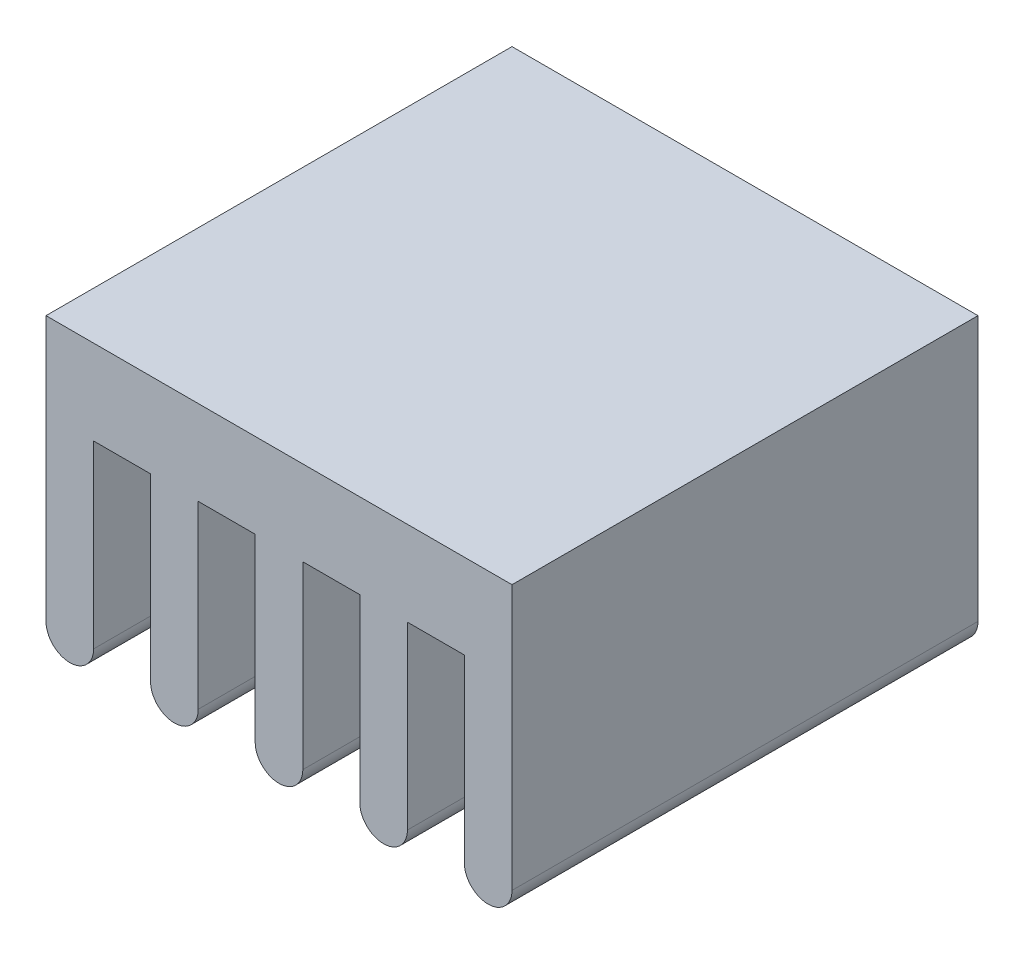
ISO-10303-21;
HEADER;
FILE_DESCRIPTION(('STEP AP214'),'2;1');
FILE_NAME('part.step','',(''),(''),'','','');
FILE_SCHEMA(('AUTOMOTIVE_DESIGN { 1 0 10303 214 1 1 1 1 }'));
ENDSEC;
DATA;
#1=APPLICATION_CONTEXT('core data for automotive mechanical design processes');
#2=APPLICATION_PROTOCOL_DEFINITION('international standard','automotive_design',2000,#1);
#3=PRODUCT_CONTEXT('',#1,'mechanical');
#4=PRODUCT('Part','Part','',(#3));
#5=PRODUCT_RELATED_PRODUCT_CATEGORY('part','',(#4));
#6=PRODUCT_DEFINITION_FORMATION('','',#4);
#7=PRODUCT_DEFINITION_CONTEXT('part definition',#1,'design');
#8=PRODUCT_DEFINITION('design','',#6,#7);
#9=PRODUCT_DEFINITION_SHAPE('','',#8);
#10=(LENGTH_UNIT() NAMED_UNIT(*) SI_UNIT(.MILLI.,.METRE.));
#11=(NAMED_UNIT(*) PLANE_ANGLE_UNIT() SI_UNIT($,.RADIAN.));
#12=(NAMED_UNIT(*) SI_UNIT($,.STERADIAN.) SOLID_ANGLE_UNIT());
#13=UNCERTAINTY_MEASURE_WITH_UNIT(LENGTH_MEASURE(1.E-05),#10,'distance_accuracy_value','');
#14=(GEOMETRIC_REPRESENTATION_CONTEXT(3) GLOBAL_UNCERTAINTY_ASSIGNED_CONTEXT((#13)) GLOBAL_UNIT_ASSIGNED_CONTEXT((#10,
#11,#12)) REPRESENTATION_CONTEXT('',''));
#15=CARTESIAN_POINT('',(0.,0.,0.));
#16=DIRECTION('',(0.,0.,1.));
#17=DIRECTION('',(1.,0.,0.));
#18=AXIS2_PLACEMENT_3D('',#15,#16,#17);
#19=CARTESIAN_POINT('',(0.,0.,4.4));
#20=DIRECTION('',(1.,0.,0.));
#21=DIRECTION('',(0.,1.,0.));
#22=AXIS2_PLACEMENT_3D('',#19,#20,#21);
#23=PLANE('',#22);
#24=DIRECTION('',(0.,-1.,0.));
#25=VECTOR('',#24,1.);
#26=CARTESIAN_POINT('',(0.,0.,-4.4));
#27=LINE('',#26,#25);
#28=CARTESIAN_POINT('',(0.,0.,-4.4));
#29=VERTEX_POINT('',#28);
#30=CARTESIAN_POINT('',(0.,-5.,-4.4));
#31=VERTEX_POINT('',#30);
#32=EDGE_CURVE('E201',#29,#31,#27,.T.);
#33=ORIENTED_EDGE('',*,*,#32,.T.);
#34=DIRECTION('',(0.,0.,-1.));
#35=VECTOR('',#34,1.);
#36=CARTESIAN_POINT('',(0.,-5.,4.4));
#37=LINE('',#36,#35);
#38=CARTESIAN_POINT('',(0.,-5.,4.4));
#39=VERTEX_POINT('',#38);
#40=EDGE_CURVE('E11',#39,#31,#37,.T.);
#41=ORIENTED_EDGE('',*,*,#40,.F.);
#42=DIRECTION('',(0.,-1.,0.));
#43=VECTOR('',#42,1.);
#44=CARTESIAN_POINT('',(0.,0.,4.4));
#45=LINE('',#44,#43);
#46=CARTESIAN_POINT('',(0.,0.,4.4));
#47=VERTEX_POINT('',#46);
#48=EDGE_CURVE('E239',#47,#39,#45,.T.);
#49=ORIENTED_EDGE('',*,*,#48,.F.);
#50=DIRECTION('',(0.,0.,-1.));
#51=VECTOR('',#50,1.);
#52=CARTESIAN_POINT('',(0.,0.,4.4));
#53=LINE('',#52,#51);
#54=EDGE_CURVE('E197',#47,#29,#53,.T.);
#55=ORIENTED_EDGE('',*,*,#54,.T.);
#56=EDGE_LOOP('',(#33,#41,#49,#55));
#57=FACE_BOUND('',#56,.T.);
#58=ADVANCED_FACE('F33',(#57),#23,.F.);
#59=CARTESIAN_POINT('',(0.450000000000001,-5.,4.4));
#60=DIRECTION('',(0.,0.,-1.));
#61=DIRECTION('',(-1.,0.,0.));
#62=AXIS2_PLACEMENT_3D('',#59,#60,#61);
#63=CYLINDRICAL_SURFACE('',#62,0.45);
#64=CARTESIAN_POINT('',(0.450000000000001,-5.,-4.4));
#65=DIRECTION('',(0.,0.,1.));
#66=DIRECTION('',(1.,0.,0.));
#67=AXIS2_PLACEMENT_3D('',#64,#65,#66);
#68=CIRCLE('',#67,0.45);
#69=CARTESIAN_POINT('',(0.900000000000001,-5.,-4.4));
#70=VERTEX_POINT('',#69);
#71=EDGE_CURVE('E204',#31,#70,#68,.T.);
#72=ORIENTED_EDGE('',*,*,#71,.T.);
#73=DIRECTION('',(0.,0.,-1.));
#74=VECTOR('',#73,1.);
#75=CARTESIAN_POINT('',(0.900000000000001,-5.,4.4));
#76=LINE('',#75,#74);
#77=CARTESIAN_POINT('',(0.900000000000001,-5.,4.4));
#78=VERTEX_POINT('',#77);
#79=EDGE_CURVE('E41',#78,#70,#76,.T.);
#80=ORIENTED_EDGE('',*,*,#79,.F.);
#81=CARTESIAN_POINT('',(0.450000000000001,-5.,4.4));
#82=DIRECTION('',(0.,0.,1.));
#83=DIRECTION('',(1.,0.,0.));
#84=AXIS2_PLACEMENT_3D('',#81,#82,#83);
#85=CIRCLE('',#84,0.45);
#86=EDGE_CURVE('E128',#39,#78,#85,.T.);
#87=ORIENTED_EDGE('',*,*,#86,.F.);
#88=ORIENTED_EDGE('',*,*,#40,.T.);
#89=EDGE_LOOP('',(#72,#80,#87,#88));
#90=FACE_BOUND('',#89,.T.);
#91=ADVANCED_FACE('F357',(#90),#63,.T.);
#92=CARTESIAN_POINT('',(0.9,-1.6,4.4));
#93=DIRECTION('',(-1.,0.,0.));
#94=DIRECTION('',(0.,-1.,0.));
#95=AXIS2_PLACEMENT_3D('',#92,#93,#94);
#96=PLANE('',#95);
#97=DIRECTION('',(0.,1.,0.));
#98=VECTOR('',#97,1.);
#99=CARTESIAN_POINT('',(0.9,-1.6,-4.4));
#100=LINE('',#99,#98);
#101=CARTESIAN_POINT('',(0.9,-1.6,-4.4));
#102=VERTEX_POINT('',#101);
#103=EDGE_CURVE('E206',#70,#102,#100,.T.);
#104=ORIENTED_EDGE('',*,*,#103,.T.);
#105=DIRECTION('',(0.,0.,-1.));
#106=VECTOR('',#105,1.);
#107=CARTESIAN_POINT('',(0.9,-1.6,4.4));
#108=LINE('',#107,#106);
#109=CARTESIAN_POINT('',(0.9,-1.6,4.4));
#110=VERTEX_POINT('',#109);
#111=EDGE_CURVE('E282',#110,#102,#108,.T.);
#112=ORIENTED_EDGE('',*,*,#111,.F.);
#113=DIRECTION('',(0.,1.,0.));
#114=VECTOR('',#113,1.);
#115=CARTESIAN_POINT('',(0.9,-1.6,4.4));
#116=LINE('',#115,#114);
#117=EDGE_CURVE('E290',#78,#110,#116,.T.);
#118=ORIENTED_EDGE('',*,*,#117,.F.);
#119=ORIENTED_EDGE('',*,*,#79,.T.);
#120=EDGE_LOOP('',(#104,#112,#118,#119));
#121=FACE_BOUND('',#120,.T.);
#122=ADVANCED_FACE('F288',(#121),#96,.F.);
#123=CARTESIAN_POINT('',(0.9,-1.6,4.4));
#124=DIRECTION('',(0.,1.,0.));
#125=DIRECTION('',(0.,0.,1.));
#126=AXIS2_PLACEMENT_3D('',#123,#124,#125);
#127=PLANE('',#126);
#128=DIRECTION('',(1.,0.,0.));
#129=VECTOR('',#128,1.);
#130=CARTESIAN_POINT('',(0.9,-1.6,-4.4));
#131=LINE('',#130,#129);
#132=CARTESIAN_POINT('',(1.975,-1.6,-4.4));
#133=VERTEX_POINT('',#132);
#134=EDGE_CURVE('E208',#102,#133,#131,.T.);
#135=ORIENTED_EDGE('',*,*,#134,.T.);
#136=DIRECTION('',(0.,0.,-1.));
#137=VECTOR('',#136,1.);
#138=CARTESIAN_POINT('',(1.975,-1.6,4.4));
#139=LINE('',#138,#137);
#140=CARTESIAN_POINT('',(1.975,-1.6,4.4));
#141=VERTEX_POINT('',#140);
#142=EDGE_CURVE('E279',#141,#133,#139,.T.);
#143=ORIENTED_EDGE('',*,*,#142,.F.);
#144=DIRECTION('',(1.,0.,0.));
#145=VECTOR('',#144,1.);
#146=CARTESIAN_POINT('',(0.9,-1.6,4.4));
#147=LINE('',#146,#145);
#148=EDGE_CURVE('E308',#110,#141,#147,.T.);
#149=ORIENTED_EDGE('',*,*,#148,.F.);
#150=ORIENTED_EDGE('',*,*,#111,.T.);
#151=EDGE_LOOP('',(#135,#143,#149,#150));
#152=FACE_BOUND('',#151,.T.);
#153=ADVANCED_FACE('F299',(#152),#127,.F.);
#154=CARTESIAN_POINT('',(1.975,-1.6,4.4));
#155=DIRECTION('',(1.,0.,0.));
#156=DIRECTION('',(0.,1.,0.));
#157=AXIS2_PLACEMENT_3D('',#154,#155,#156);
#158=PLANE('',#157);
#159=DIRECTION('',(0.,-1.,0.));
#160=VECTOR('',#159,1.);
#161=CARTESIAN_POINT('',(1.975,-1.6,-4.4));
#162=LINE('',#161,#160);
#163=CARTESIAN_POINT('',(1.975,-5.,-4.4));
#164=VERTEX_POINT('',#163);
#165=EDGE_CURVE('E210',#133,#164,#162,.T.);
#166=ORIENTED_EDGE('',*,*,#165,.T.);
#167=DIRECTION('',(0.,0.,-1.));
#168=VECTOR('',#167,1.);
#169=CARTESIAN_POINT('',(1.975,-5.,4.4));
#170=LINE('',#169,#168);
#171=CARTESIAN_POINT('',(1.975,-5.,4.4));
#172=VERTEX_POINT('',#171);
#173=EDGE_CURVE('E276',#172,#164,#170,.T.);
#174=ORIENTED_EDGE('',*,*,#173,.F.);
#175=DIRECTION('',(0.,-1.,0.));
#176=VECTOR('',#175,1.);
#177=CARTESIAN_POINT('',(1.975,-1.6,4.4));
#178=LINE('',#177,#176);
#179=EDGE_CURVE('E305',#141,#172,#178,.T.);
#180=ORIENTED_EDGE('',*,*,#179,.F.);
#181=ORIENTED_EDGE('',*,*,#142,.T.);
#182=EDGE_LOOP('',(#166,#174,#180,#181));
#183=FACE_BOUND('',#182,.T.);
#184=ADVANCED_FACE('F303',(#183),#158,.F.);
#185=CARTESIAN_POINT('',(2.425,-5.,4.4));
#186=DIRECTION('',(0.,0.,-1.));
#187=DIRECTION('',(-1.,0.,0.));
#188=AXIS2_PLACEMENT_3D('',#185,#186,#187);
#189=CYLINDRICAL_SURFACE('',#188,0.449999999999999);
#190=CARTESIAN_POINT('',(2.425,-5.,-4.4));
#191=DIRECTION('',(0.,0.,1.));
#192=DIRECTION('',(1.,0.,0.));
#193=AXIS2_PLACEMENT_3D('',#190,#191,#192);
#194=CIRCLE('',#193,0.449999999999999);
#195=CARTESIAN_POINT('',(2.875,-5.,-4.4));
#196=VERTEX_POINT('',#195);
#197=EDGE_CURVE('E212',#164,#196,#194,.T.);
#198=ORIENTED_EDGE('',*,*,#197,.T.);
#199=DIRECTION('',(0.,0.,-1.));
#200=VECTOR('',#199,1.);
#201=CARTESIAN_POINT('',(2.875,-5.,4.4));
#202=LINE('',#201,#200);
#203=CARTESIAN_POINT('',(2.875,-5.,4.4));
#204=VERTEX_POINT('',#203);
#205=EDGE_CURVE('E273',#204,#196,#202,.T.);
#206=ORIENTED_EDGE('',*,*,#205,.F.);
#207=CARTESIAN_POINT('',(2.425,-5.,4.4));
#208=DIRECTION('',(0.,0.,1.));
#209=DIRECTION('',(1.,0.,0.));
#210=AXIS2_PLACEMENT_3D('',#207,#208,#209);
#211=CIRCLE('',#210,0.449999999999999);
#212=EDGE_CURVE('E307',#172,#204,#211,.T.);
#213=ORIENTED_EDGE('',*,*,#212,.F.);
#214=ORIENTED_EDGE('',*,*,#173,.T.);
#215=EDGE_LOOP('',(#198,#206,#213,#214));
#216=FACE_BOUND('',#215,.T.);
#217=ADVANCED_FACE('F370',(#216),#189,.T.);
#218=CARTESIAN_POINT('',(2.875,-5.,4.4));
#219=DIRECTION('',(-1.,0.,0.));
#220=DIRECTION('',(0.,0.,1.));
#221=AXIS2_PLACEMENT_3D('',#218,#219,#220);
#222=PLANE('',#221);
#223=DIRECTION('',(0.,1.,0.));
#224=VECTOR('',#223,1.);
#225=CARTESIAN_POINT('',(2.875,-5.,-4.4));
#226=LINE('',#225,#224);
#227=CARTESIAN_POINT('',(2.875,-1.6,-4.4));
#228=VERTEX_POINT('',#227);
#229=EDGE_CURVE('E214',#196,#228,#226,.T.);
#230=ORIENTED_EDGE('',*,*,#229,.T.);
#231=DIRECTION('',(0.,0.,-1.));
#232=VECTOR('',#231,1.);
#233=CARTESIAN_POINT('',(2.875,-1.6,4.4));
#234=LINE('',#233,#232);
#235=CARTESIAN_POINT('',(2.875,-1.6,4.4));
#236=VERTEX_POINT('',#235);
#237=EDGE_CURVE('E270',#236,#228,#234,.T.);
#238=ORIENTED_EDGE('',*,*,#237,.F.);
#239=DIRECTION('',(0.,1.,0.));
#240=VECTOR('',#239,1.);
#241=CARTESIAN_POINT('',(2.875,-5.,4.4));
#242=LINE('',#241,#240);
#243=EDGE_CURVE('E310',#204,#236,#242,.T.);
#244=ORIENTED_EDGE('',*,*,#243,.F.);
#245=ORIENTED_EDGE('',*,*,#205,.T.);
#246=EDGE_LOOP('',(#230,#238,#244,#245));
#247=FACE_BOUND('',#246,.T.);
#248=ADVANCED_FACE('F373',(#247),#222,.F.);
#249=CARTESIAN_POINT('',(2.875,-1.6,4.4));
#250=DIRECTION('',(0.,1.,0.));
#251=DIRECTION('',(0.,0.,1.));
#252=AXIS2_PLACEMENT_3D('',#249,#250,#251);
#253=PLANE('',#252);
#254=DIRECTION('',(1.,0.,0.));
#255=VECTOR('',#254,1.);
#256=CARTESIAN_POINT('',(2.875,-1.6,-4.4));
#257=LINE('',#256,#255);
#258=CARTESIAN_POINT('',(3.95,-1.6,-4.4));
#259=VERTEX_POINT('',#258);
#260=EDGE_CURVE('E216',#228,#259,#257,.T.);
#261=ORIENTED_EDGE('',*,*,#260,.T.);
#262=DIRECTION('',(0.,0.,-1.));
#263=VECTOR('',#262,1.);
#264=CARTESIAN_POINT('',(3.95,-1.6,4.4));
#265=LINE('',#264,#263);
#266=CARTESIAN_POINT('',(3.95,-1.6,4.4));
#267=VERTEX_POINT('',#266);
#268=EDGE_CURVE('E267',#267,#259,#265,.T.);
#269=ORIENTED_EDGE('',*,*,#268,.F.);
#270=DIRECTION('',(1.,0.,0.));
#271=VECTOR('',#270,1.);
#272=CARTESIAN_POINT('',(2.875,-1.6,4.4));
#273=LINE('',#272,#271);
#274=EDGE_CURVE('E316',#236,#267,#273,.T.);
#275=ORIENTED_EDGE('',*,*,#274,.F.);
#276=ORIENTED_EDGE('',*,*,#237,.T.);
#277=EDGE_LOOP('',(#261,#269,#275,#276));
#278=FACE_BOUND('',#277,.T.);
#279=ADVANCED_FACE('F377',(#278),#253,.F.);
#280=CARTESIAN_POINT('',(3.95,-1.6,4.4));
#281=DIRECTION('',(1.,0.,0.));
#282=DIRECTION('',(0.,0.,-1.));
#283=AXIS2_PLACEMENT_3D('',#280,#281,#282);
#284=PLANE('',#283);
#285=DIRECTION('',(0.,-1.,0.));
#286=VECTOR('',#285,1.);
#287=CARTESIAN_POINT('',(3.95,-1.6,-4.4));
#288=LINE('',#287,#286);
#289=CARTESIAN_POINT('',(3.95,-5.,-4.4));
#290=VERTEX_POINT('',#289);
#291=EDGE_CURVE('E218',#259,#290,#288,.T.);
#292=ORIENTED_EDGE('',*,*,#291,.T.);
#293=DIRECTION('',(0.,0.,-1.));
#294=VECTOR('',#293,1.);
#295=CARTESIAN_POINT('',(3.95,-5.,4.4));
#296=LINE('',#295,#294);
#297=CARTESIAN_POINT('',(3.95,-5.,4.4));
#298=VERTEX_POINT('',#297);
#299=EDGE_CURVE('E264',#298,#290,#296,.T.);
#300=ORIENTED_EDGE('',*,*,#299,.F.);
#301=DIRECTION('',(0.,-1.,0.));
#302=VECTOR('',#301,1.);
#303=CARTESIAN_POINT('',(3.95,-1.6,4.4));
#304=LINE('',#303,#302);
#305=EDGE_CURVE('E318',#267,#298,#304,.T.);
#306=ORIENTED_EDGE('',*,*,#305,.F.);
#307=ORIENTED_EDGE('',*,*,#268,.T.);
#308=EDGE_LOOP('',(#292,#300,#306,#307));
#309=FACE_BOUND('',#308,.T.);
#310=ADVANCED_FACE('F381',(#309),#284,.F.);
#311=CARTESIAN_POINT('',(4.4,-5.,4.4));
#312=DIRECTION('',(0.,0.,-1.));
#313=DIRECTION('',(-1.,0.,0.));
#314=AXIS2_PLACEMENT_3D('',#311,#312,#313);
#315=CYLINDRICAL_SURFACE('',#314,0.45);
#316=CARTESIAN_POINT('',(4.4,-5.,-4.4));
#317=DIRECTION('',(0.,0.,1.));
#318=DIRECTION('',(1.,0.,0.));
#319=AXIS2_PLACEMENT_3D('',#316,#317,#318);
#320=CIRCLE('',#319,0.45);
#321=CARTESIAN_POINT('',(4.85,-5.,-4.4));
#322=VERTEX_POINT('',#321);
#323=EDGE_CURVE('E220',#290,#322,#320,.T.);
#324=ORIENTED_EDGE('',*,*,#323,.T.);
#325=DIRECTION('',(0.,0.,-1.));
#326=VECTOR('',#325,1.);
#327=CARTESIAN_POINT('',(4.85,-5.,4.4));
#328=LINE('',#327,#326);
#329=CARTESIAN_POINT('',(4.85,-5.,4.4));
#330=VERTEX_POINT('',#329);
#331=EDGE_CURVE('E261',#330,#322,#328,.T.);
#332=ORIENTED_EDGE('',*,*,#331,.F.);
#333=CARTESIAN_POINT('',(4.4,-5.,4.4));
#334=DIRECTION('',(0.,0.,1.));
#335=DIRECTION('',(1.,0.,0.));
#336=AXIS2_PLACEMENT_3D('',#333,#334,#335);
#337=CIRCLE('',#336,0.45);
#338=EDGE_CURVE('E320',#298,#330,#337,.T.);
#339=ORIENTED_EDGE('',*,*,#338,.F.);
#340=ORIENTED_EDGE('',*,*,#299,.T.);
#341=EDGE_LOOP('',(#324,#332,#339,#340));
#342=FACE_BOUND('',#341,.T.);
#343=ADVANCED_FACE('F385',(#342),#315,.T.);
#344=CARTESIAN_POINT('',(4.85,-5.,4.4));
#345=DIRECTION('',(-1.,0.,0.));
#346=DIRECTION('',(0.,0.,1.));
#347=AXIS2_PLACEMENT_3D('',#344,#345,#346);
#348=PLANE('',#347);
#349=DIRECTION('',(0.,1.,0.));
#350=VECTOR('',#349,1.);
#351=CARTESIAN_POINT('',(4.85,-5.,-4.4));
#352=LINE('',#351,#350);
#353=CARTESIAN_POINT('',(4.85,-1.6,-4.4));
#354=VERTEX_POINT('',#353);
#355=EDGE_CURVE('E222',#322,#354,#352,.T.);
#356=ORIENTED_EDGE('',*,*,#355,.T.);
#357=DIRECTION('',(0.,0.,-1.));
#358=VECTOR('',#357,1.);
#359=CARTESIAN_POINT('',(4.85,-1.6,4.4));
#360=LINE('',#359,#358);
#361=CARTESIAN_POINT('',(4.85,-1.6,4.4));
#362=VERTEX_POINT('',#361);
#363=EDGE_CURVE('E258',#362,#354,#360,.T.);
#364=ORIENTED_EDGE('',*,*,#363,.F.);
#365=DIRECTION('',(0.,1.,0.));
#366=VECTOR('',#365,1.);
#367=CARTESIAN_POINT('',(4.85,-5.,4.4));
#368=LINE('',#367,#366);
#369=EDGE_CURVE('E322',#330,#362,#368,.T.);
#370=ORIENTED_EDGE('',*,*,#369,.F.);
#371=ORIENTED_EDGE('',*,*,#331,.T.);
#372=EDGE_LOOP('',(#356,#364,#370,#371));
#373=FACE_BOUND('',#372,.T.);
#374=ADVANCED_FACE('F389',(#373),#348,.F.);
#375=CARTESIAN_POINT('',(4.85,-1.6,4.4));
#376=DIRECTION('',(0.,1.,0.));
#377=DIRECTION('',(0.,0.,1.));
#378=AXIS2_PLACEMENT_3D('',#375,#376,#377);
#379=PLANE('',#378);
#380=DIRECTION('',(1.,0.,0.));
#381=VECTOR('',#380,1.);
#382=CARTESIAN_POINT('',(4.85,-1.6,-4.4));
#383=LINE('',#382,#381);
#384=CARTESIAN_POINT('',(5.925,-1.6,-4.4));
#385=VERTEX_POINT('',#384);
#386=EDGE_CURVE('E224',#354,#385,#383,.T.);
#387=ORIENTED_EDGE('',*,*,#386,.T.);
#388=DIRECTION('',(0.,0.,-1.));
#389=VECTOR('',#388,1.);
#390=CARTESIAN_POINT('',(5.925,-1.6,4.4));
#391=LINE('',#390,#389);
#392=CARTESIAN_POINT('',(5.925,-1.6,4.4));
#393=VERTEX_POINT('',#392);
#394=EDGE_CURVE('E255',#393,#385,#391,.T.);
#395=ORIENTED_EDGE('',*,*,#394,.F.);
#396=DIRECTION('',(1.,0.,0.));
#397=VECTOR('',#396,1.);
#398=CARTESIAN_POINT('',(4.85,-1.6,4.4));
#399=LINE('',#398,#397);
#400=EDGE_CURVE('E324',#362,#393,#399,.T.);
#401=ORIENTED_EDGE('',*,*,#400,.F.);
#402=ORIENTED_EDGE('',*,*,#363,.T.);
#403=EDGE_LOOP('',(#387,#395,#401,#402));
#404=FACE_BOUND('',#403,.T.);
#405=ADVANCED_FACE('F393',(#404),#379,.F.);
#406=CARTESIAN_POINT('',(5.925,-1.6,4.4));
#407=DIRECTION('',(1.,0.,0.));
#408=DIRECTION('',(0.,0.,-1.));
#409=AXIS2_PLACEMENT_3D('',#406,#407,#408);
#410=PLANE('',#409);
#411=DIRECTION('',(0.,-1.,0.));
#412=VECTOR('',#411,1.);
#413=CARTESIAN_POINT('',(5.925,-1.6,-4.4));
#414=LINE('',#413,#412);
#415=CARTESIAN_POINT('',(5.925,-5.,-4.4));
#416=VERTEX_POINT('',#415);
#417=EDGE_CURVE('E226',#385,#416,#414,.T.);
#418=ORIENTED_EDGE('',*,*,#417,.T.);
#419=DIRECTION('',(0.,0.,-1.));
#420=VECTOR('',#419,1.);
#421=CARTESIAN_POINT('',(5.925,-5.,4.4));
#422=LINE('',#421,#420);
#423=CARTESIAN_POINT('',(5.925,-5.,4.4));
#424=VERTEX_POINT('',#423);
#425=EDGE_CURVE('E252',#424,#416,#422,.T.);
#426=ORIENTED_EDGE('',*,*,#425,.F.);
#427=DIRECTION('',(0.,-1.,0.));
#428=VECTOR('',#427,1.);
#429=CARTESIAN_POINT('',(5.925,-1.6,4.4));
#430=LINE('',#429,#428);
#431=EDGE_CURVE('E326',#393,#424,#430,.T.);
#432=ORIENTED_EDGE('',*,*,#431,.F.);
#433=ORIENTED_EDGE('',*,*,#394,.T.);
#434=EDGE_LOOP('',(#418,#426,#432,#433));
#435=FACE_BOUND('',#434,.T.);
#436=ADVANCED_FACE('F397',(#435),#410,.F.);
#437=CARTESIAN_POINT('',(6.375,-5.,4.4));
#438=DIRECTION('',(0.,0.,-1.));
#439=DIRECTION('',(-1.,0.,0.));
#440=AXIS2_PLACEMENT_3D('',#437,#438,#439);
#441=CYLINDRICAL_SURFACE('',#440,0.45);
#442=CARTESIAN_POINT('',(6.375,-5.,-4.4));
#443=DIRECTION('',(0.,0.,1.));
#444=DIRECTION('',(1.,0.,0.));
#445=AXIS2_PLACEMENT_3D('',#442,#443,#444);
#446=CIRCLE('',#445,0.45);
#447=CARTESIAN_POINT('',(6.825,-5.,-4.4));
#448=VERTEX_POINT('',#447);
#449=EDGE_CURVE('E228',#416,#448,#446,.T.);
#450=ORIENTED_EDGE('',*,*,#449,.T.);
#451=DIRECTION('',(0.,0.,-1.));
#452=VECTOR('',#451,1.);
#453=CARTESIAN_POINT('',(6.825,-5.,4.4));
#454=LINE('',#453,#452);
#455=CARTESIAN_POINT('',(6.825,-5.,4.4));
#456=VERTEX_POINT('',#455);
#457=EDGE_CURVE('E249',#456,#448,#454,.T.);
#458=ORIENTED_EDGE('',*,*,#457,.F.);
#459=CARTESIAN_POINT('',(6.375,-5.,4.4));
#460=DIRECTION('',(0.,0.,1.));
#461=DIRECTION('',(1.,0.,0.));
#462=AXIS2_PLACEMENT_3D('',#459,#460,#461);
#463=CIRCLE('',#462,0.45);
#464=EDGE_CURVE('E328',#424,#456,#463,.T.);
#465=ORIENTED_EDGE('',*,*,#464,.F.);
#466=ORIENTED_EDGE('',*,*,#425,.T.);
#467=EDGE_LOOP('',(#450,#458,#465,#466));
#468=FACE_BOUND('',#467,.T.);
#469=ADVANCED_FACE('F401',(#468),#441,.T.);
#470=CARTESIAN_POINT('',(6.825,-5.,4.4));
#471=DIRECTION('',(-1.,0.,0.));
#472=DIRECTION('',(0.,0.,1.));
#473=AXIS2_PLACEMENT_3D('',#470,#471,#472);
#474=PLANE('',#473);
#475=DIRECTION('',(0.,1.,0.));
#476=VECTOR('',#475,1.);
#477=CARTESIAN_POINT('',(6.825,-5.,-4.4));
#478=LINE('',#477,#476);
#479=CARTESIAN_POINT('',(6.825,-1.6,-4.4));
#480=VERTEX_POINT('',#479);
#481=EDGE_CURVE('E230',#448,#480,#478,.T.);
#482=ORIENTED_EDGE('',*,*,#481,.T.);
#483=DIRECTION('',(0.,0.,-1.));
#484=VECTOR('',#483,1.);
#485=CARTESIAN_POINT('',(6.825,-1.6,4.4));
#486=LINE('',#485,#484);
#487=CARTESIAN_POINT('',(6.825,-1.6,4.4));
#488=VERTEX_POINT('',#487);
#489=EDGE_CURVE('E246',#488,#480,#486,.T.);
#490=ORIENTED_EDGE('',*,*,#489,.F.);
#491=DIRECTION('',(0.,1.,0.));
#492=VECTOR('',#491,1.);
#493=CARTESIAN_POINT('',(6.825,-5.,4.4));
#494=LINE('',#493,#492);
#495=EDGE_CURVE('E330',#456,#488,#494,.T.);
#496=ORIENTED_EDGE('',*,*,#495,.F.);
#497=ORIENTED_EDGE('',*,*,#457,.T.);
#498=EDGE_LOOP('',(#482,#490,#496,#497));
#499=FACE_BOUND('',#498,.T.);
#500=ADVANCED_FACE('F405',(#499),#474,.F.);
#501=CARTESIAN_POINT('',(6.825,-1.6,4.4));
#502=DIRECTION('',(0.,1.,0.));
#503=DIRECTION('',(0.,0.,1.));
#504=AXIS2_PLACEMENT_3D('',#501,#502,#503);
#505=PLANE('',#504);
#506=DIRECTION('',(1.,0.,0.));
#507=VECTOR('',#506,1.);
#508=CARTESIAN_POINT('',(6.825,-1.6,-4.4));
#509=LINE('',#508,#507);
#510=CARTESIAN_POINT('',(7.9,-1.6,-4.4));
#511=VERTEX_POINT('',#510);
#512=EDGE_CURVE('E232',#480,#511,#509,.T.);
#513=ORIENTED_EDGE('',*,*,#512,.T.);
#514=DIRECTION('',(0.,0.,-1.));
#515=VECTOR('',#514,1.);
#516=CARTESIAN_POINT('',(7.9,-1.6,4.4));
#517=LINE('',#516,#515);
#518=CARTESIAN_POINT('',(7.9,-1.6,4.4));
#519=VERTEX_POINT('',#518);
#520=EDGE_CURVE('E243',#519,#511,#517,.T.);
#521=ORIENTED_EDGE('',*,*,#520,.F.);
#522=DIRECTION('',(1.,0.,0.));
#523=VECTOR('',#522,1.);
#524=CARTESIAN_POINT('',(6.825,-1.6,4.4));
#525=LINE('',#524,#523);
#526=EDGE_CURVE('E332',#488,#519,#525,.T.);
#527=ORIENTED_EDGE('',*,*,#526,.F.);
#528=ORIENTED_EDGE('',*,*,#489,.T.);
#529=EDGE_LOOP('',(#513,#521,#527,#528));
#530=FACE_BOUND('',#529,.T.);
#531=ADVANCED_FACE('F338',(#530),#505,.F.);
#532=CARTESIAN_POINT('',(7.9,-1.6,4.4));
#533=DIRECTION('',(1.,0.,0.));
#534=DIRECTION('',(0.,0.,-1.));
#535=AXIS2_PLACEMENT_3D('',#532,#533,#534);
#536=PLANE('',#535);
#537=DIRECTION('',(0.,-1.,0.));
#538=VECTOR('',#537,1.);
#539=CARTESIAN_POINT('',(7.9,-1.6,-4.4));
#540=LINE('',#539,#538);
#541=CARTESIAN_POINT('',(7.9,-5.,-4.4));
#542=VERTEX_POINT('',#541);
#543=EDGE_CURVE('E234',#511,#542,#540,.T.);
#544=ORIENTED_EDGE('',*,*,#543,.T.);
#545=DIRECTION('',(0.,0.,-1.));
#546=VECTOR('',#545,1.);
#547=CARTESIAN_POINT('',(7.9,-5.,4.4));
#548=LINE('',#547,#546);
#549=CARTESIAN_POINT('',(7.9,-5.,4.4));
#550=VERTEX_POINT('',#549);
#551=EDGE_CURVE('E192',#550,#542,#548,.T.);
#552=ORIENTED_EDGE('',*,*,#551,.F.);
#553=DIRECTION('',(0.,-1.,0.));
#554=VECTOR('',#553,1.);
#555=CARTESIAN_POINT('',(7.9,-1.6,4.4));
#556=LINE('',#555,#554);
#557=EDGE_CURVE('E183',#519,#550,#556,.T.);
#558=ORIENTED_EDGE('',*,*,#557,.F.);
#559=ORIENTED_EDGE('',*,*,#520,.T.);
#560=EDGE_LOOP('',(#544,#552,#558,#559));
#561=FACE_BOUND('',#560,.T.);
#562=ADVANCED_FACE('F342',(#561),#536,.F.);
#563=CARTESIAN_POINT('',(8.35,-5.,4.4));
#564=DIRECTION('',(0.,0.,-1.));
#565=DIRECTION('',(-1.,0.,0.));
#566=AXIS2_PLACEMENT_3D('',#563,#564,#565);
#567=CYLINDRICAL_SURFACE('',#566,0.45);
#568=CARTESIAN_POINT('',(8.35,-5.,-4.4));
#569=DIRECTION('',(0.,0.,1.));
#570=DIRECTION('',(1.,0.,0.));
#571=AXIS2_PLACEMENT_3D('',#568,#569,#570);
#572=CIRCLE('',#571,0.45);
#573=CARTESIAN_POINT('',(8.8,-5.,-4.4));
#574=VERTEX_POINT('',#573);
#575=EDGE_CURVE('E191',#542,#574,#572,.T.);
#576=ORIENTED_EDGE('',*,*,#575,.T.);
#577=DIRECTION('',(0.,0.,-1.));
#578=VECTOR('',#577,1.);
#579=CARTESIAN_POINT('',(8.8,-5.,4.4));
#580=LINE('',#579,#578);
#581=CARTESIAN_POINT('',(8.8,-5.,4.4));
#582=VERTEX_POINT('',#581);
#583=EDGE_CURVE('E188',#582,#574,#580,.T.);
#584=ORIENTED_EDGE('',*,*,#583,.F.);
#585=CARTESIAN_POINT('',(8.35,-5.,4.4));
#586=DIRECTION('',(0.,0.,1.));
#587=DIRECTION('',(1.,0.,0.));
#588=AXIS2_PLACEMENT_3D('',#585,#586,#587);
#589=CIRCLE('',#588,0.45);
#590=EDGE_CURVE('E177',#550,#582,#589,.T.);
#591=ORIENTED_EDGE('',*,*,#590,.F.);
#592=ORIENTED_EDGE('',*,*,#551,.T.);
#593=EDGE_LOOP('',(#576,#584,#591,#592));
#594=FACE_BOUND('',#593,.T.);
#595=ADVANCED_FACE('F189',(#594),#567,.T.);
#596=CARTESIAN_POINT('',(8.8,0.,4.4));
#597=DIRECTION('',(-1.,0.,0.));
#598=DIRECTION('',(0.,0.,1.));
#599=AXIS2_PLACEMENT_3D('',#596,#597,#598);
#600=PLANE('',#599);
#601=DIRECTION('',(0.,1.,0.));
#602=VECTOR('',#601,1.);
#603=CARTESIAN_POINT('',(8.8,0.,-4.4));
#604=LINE('',#603,#602);
#605=CARTESIAN_POINT('',(8.8,0.,-4.4));
#606=VERTEX_POINT('',#605);
#607=EDGE_CURVE('E114',#574,#606,#604,.T.);
#608=ORIENTED_EDGE('',*,*,#607,.T.);
#609=DIRECTION('',(0.,0.,-1.));
#610=VECTOR('',#609,1.);
#611=CARTESIAN_POINT('',(8.8,0.,4.4));
#612=LINE('',#611,#610);
#613=CARTESIAN_POINT('',(8.8,0.,4.4));
#614=VERTEX_POINT('',#613);
#615=EDGE_CURVE('E193',#614,#606,#612,.T.);
#616=ORIENTED_EDGE('',*,*,#615,.F.);
#617=DIRECTION('',(0.,1.,0.));
#618=VECTOR('',#617,1.);
#619=CARTESIAN_POINT('',(8.8,0.,4.4));
#620=LINE('',#619,#618);
#621=EDGE_CURVE('E181',#582,#614,#620,.T.);
#622=ORIENTED_EDGE('',*,*,#621,.F.);
#623=ORIENTED_EDGE('',*,*,#583,.T.);
#624=EDGE_LOOP('',(#608,#616,#622,#623));
#625=FACE_BOUND('',#624,.T.);
#626=ADVANCED_FACE('F195',(#625),#600,.F.);
#627=CARTESIAN_POINT('',(0.,0.,4.4));
#628=DIRECTION('',(0.,-1.,0.));
#629=DIRECTION('',(1.,0.,0.));
#630=AXIS2_PLACEMENT_3D('',#627,#628,#629);
#631=PLANE('',#630);
#632=DIRECTION('',(-1.,0.,0.));
#633=VECTOR('',#632,1.);
#634=CARTESIAN_POINT('',(0.,0.,-4.4));
#635=LINE('',#634,#633);
#636=EDGE_CURVE('E120',#606,#29,#635,.T.);
#637=ORIENTED_EDGE('',*,*,#636,.T.);
#638=ORIENTED_EDGE('',*,*,#54,.F.);
#639=DIRECTION('',(-1.,0.,0.));
#640=VECTOR('',#639,1.);
#641=CARTESIAN_POINT('',(0.,0.,4.4));
#642=LINE('',#641,#640);
#643=EDGE_CURVE('E49',#614,#47,#642,.T.);
#644=ORIENTED_EDGE('',*,*,#643,.F.);
#645=ORIENTED_EDGE('',*,*,#615,.T.);
#646=EDGE_LOOP('',(#637,#638,#644,#645));
#647=FACE_BOUND('',#646,.T.);
#648=ADVANCED_FACE('F346',(#647),#631,.F.);
#649=CARTESIAN_POINT('',(0.450000000000001,-5.,4.4));
#650=DIRECTION('',(0.,0.,1.));
#651=DIRECTION('',(1.,0.,0.));
#652=AXIS2_PLACEMENT_3D('',#649,#650,#651);
#653=PLANE('',#652);
#654=ORIENTED_EDGE('',*,*,#48,.T.);
#655=ORIENTED_EDGE('',*,*,#86,.T.);
#656=ORIENTED_EDGE('',*,*,#117,.T.);
#657=ORIENTED_EDGE('',*,*,#148,.T.);
#658=ORIENTED_EDGE('',*,*,#179,.T.);
#659=ORIENTED_EDGE('',*,*,#212,.T.);
#660=ORIENTED_EDGE('',*,*,#243,.T.);
#661=ORIENTED_EDGE('',*,*,#274,.T.);
#662=ORIENTED_EDGE('',*,*,#305,.T.);
#663=ORIENTED_EDGE('',*,*,#338,.T.);
#664=ORIENTED_EDGE('',*,*,#369,.T.);
#665=ORIENTED_EDGE('',*,*,#400,.T.);
#666=ORIENTED_EDGE('',*,*,#431,.T.);
#667=ORIENTED_EDGE('',*,*,#464,.T.);
#668=ORIENTED_EDGE('',*,*,#495,.T.);
#669=ORIENTED_EDGE('',*,*,#526,.T.);
#670=ORIENTED_EDGE('',*,*,#557,.T.);
#671=ORIENTED_EDGE('',*,*,#590,.T.);
#672=ORIENTED_EDGE('',*,*,#621,.T.);
#673=ORIENTED_EDGE('',*,*,#643,.T.);
#674=EDGE_LOOP('',(#654,#655,#656,#657,#658,#659,#660,#661,#662,#663,#664,#665,#666,#667,#668,
#669,#670,#671,#672,#673));
#675=FACE_BOUND('',#674,.T.);
#676=ADVANCED_FACE('F179',(#675),#653,.T.);
#677=CARTESIAN_POINT('',(0.450000000000001,-5.,-4.4));
#678=DIRECTION('',(0.,0.,1.));
#679=DIRECTION('',(1.,0.,0.));
#680=AXIS2_PLACEMENT_3D('',#677,#678,#679);
#681=PLANE('',#680);
#682=ORIENTED_EDGE('',*,*,#32,.F.);
#683=ORIENTED_EDGE('',*,*,#636,.F.);
#684=ORIENTED_EDGE('',*,*,#607,.F.);
#685=ORIENTED_EDGE('',*,*,#575,.F.);
#686=ORIENTED_EDGE('',*,*,#543,.F.);
#687=ORIENTED_EDGE('',*,*,#512,.F.);
#688=ORIENTED_EDGE('',*,*,#481,.F.);
#689=ORIENTED_EDGE('',*,*,#449,.F.);
#690=ORIENTED_EDGE('',*,*,#417,.F.);
#691=ORIENTED_EDGE('',*,*,#386,.F.);
#692=ORIENTED_EDGE('',*,*,#355,.F.);
#693=ORIENTED_EDGE('',*,*,#323,.F.);
#694=ORIENTED_EDGE('',*,*,#291,.F.);
#695=ORIENTED_EDGE('',*,*,#260,.F.);
#696=ORIENTED_EDGE('',*,*,#229,.F.);
#697=ORIENTED_EDGE('',*,*,#197,.F.);
#698=ORIENTED_EDGE('',*,*,#165,.F.);
#699=ORIENTED_EDGE('',*,*,#134,.F.);
#700=ORIENTED_EDGE('',*,*,#103,.F.);
#701=ORIENTED_EDGE('',*,*,#71,.F.);
#702=EDGE_LOOP('',(#682,#683,#684,#685,#686,#687,#688,#689,#690,#691,#692,#693,#694,#695,#696,
#697,#698,#699,#700,#701));
#703=FACE_BOUND('',#702,.T.);
#704=ADVANCED_FACE('F294',(#703),#681,.F.);
#705=CLOSED_SHELL('',(#58,#91,#122,#153,#184,#217,#248,#279,#310,#343,#374,#405,#436,#469,#500,
#531,#562,#595,#626,#648,#676,#704));
#706=MANIFOLD_SOLID_BREP('B2',#705);
#707=ADVANCED_BREP_SHAPE_REPRESENTATION('',(#18,#706),#14);
#708=SHAPE_DEFINITION_REPRESENTATION(#9,#707);
ENDSEC;
END-ISO-10303-21;
